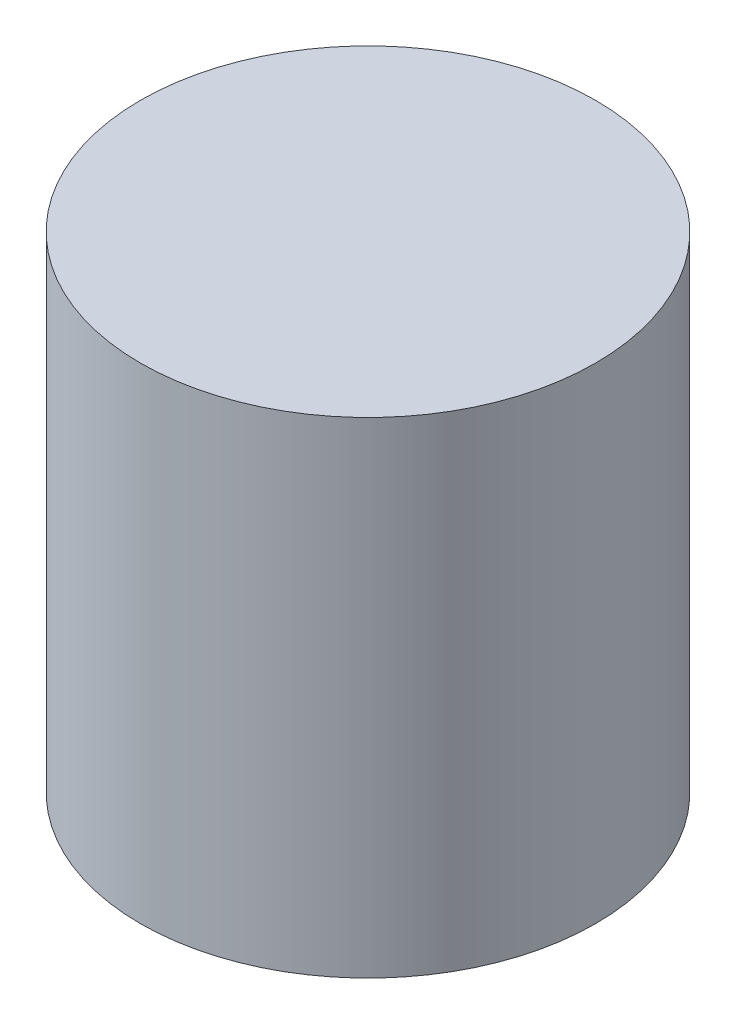
ISO-10303-21;
HEADER;
FILE_DESCRIPTION(('STEP AP214'),'2;1');
FILE_NAME('part.step','',(''),(''),'','','');
FILE_SCHEMA(('AUTOMOTIVE_DESIGN { 1 0 10303 214 1 1 1 1 }'));
ENDSEC;
DATA;
#1=APPLICATION_CONTEXT('core data for automotive mechanical design processes');
#2=APPLICATION_PROTOCOL_DEFINITION('international standard','automotive_design',2000,#1);
#3=PRODUCT_CONTEXT('',#1,'mechanical');
#4=PRODUCT('Part','Part','',(#3));
#5=PRODUCT_RELATED_PRODUCT_CATEGORY('part','',(#4));
#6=PRODUCT_DEFINITION_FORMATION('','',#4);
#7=PRODUCT_DEFINITION_CONTEXT('part definition',#1,'design');
#8=PRODUCT_DEFINITION('design','',#6,#7);
#9=PRODUCT_DEFINITION_SHAPE('','',#8);
#10=(LENGTH_UNIT() NAMED_UNIT(*) SI_UNIT(.MILLI.,.METRE.));
#11=(NAMED_UNIT(*) PLANE_ANGLE_UNIT() SI_UNIT($,.RADIAN.));
#12=(NAMED_UNIT(*) SI_UNIT($,.STERADIAN.) SOLID_ANGLE_UNIT());
#13=UNCERTAINTY_MEASURE_WITH_UNIT(LENGTH_MEASURE(1.E-05),#10,'distance_accuracy_value','');
#14=(GEOMETRIC_REPRESENTATION_CONTEXT(3) GLOBAL_UNCERTAINTY_ASSIGNED_CONTEXT((#13)) GLOBAL_UNIT_ASSIGNED_CONTEXT((#10,
#11,#12)) REPRESENTATION_CONTEXT('',''));
#15=CARTESIAN_POINT('',(0.,0.,0.));
#16=DIRECTION('',(0.,0.,1.));
#17=DIRECTION('',(1.,0.,0.));
#18=AXIS2_PLACEMENT_3D('',#15,#16,#17);
#19=CARTESIAN_POINT('',(0.,80.,0.));
#20=DIRECTION('',(0.,-1.,0.));
#21=DIRECTION('',(0.,0.,-1.));
#22=AXIS2_PLACEMENT_3D('',#19,#20,#21);
#23=CYLINDRICAL_SURFACE('',#22,37.5);
#24=CARTESIAN_POINT('',(0.,80.,0.));
#25=DIRECTION('',(0.,1.,0.));
#26=DIRECTION('',(0.,0.,1.));
#27=AXIS2_PLACEMENT_3D('',#24,#25,#26);
#28=CIRCLE('',#27,37.5);
#29=CARTESIAN_POINT('',(0.,80.,37.5));
#30=VERTEX_POINT('',#29);
#31=EDGE_CURVE('E10',#30,#30,#28,.T.);
#32=ORIENTED_EDGE('',*,*,#31,.F.);
#33=EDGE_LOOP('',(#32));
#34=FACE_BOUND('',#33,.T.);
#35=CARTESIAN_POINT('',(0.,0.,0.));
#36=DIRECTION('',(0.,1.,0.));
#37=DIRECTION('',(0.,0.,1.));
#38=AXIS2_PLACEMENT_3D('',#35,#36,#37);
#39=CIRCLE('',#38,37.5);
#40=CARTESIAN_POINT('',(0.,0.,37.5));
#41=VERTEX_POINT('',#40);
#42=EDGE_CURVE('E38',#41,#41,#39,.T.);
#43=ORIENTED_EDGE('',*,*,#42,.T.);
#44=EDGE_LOOP('',(#43));
#45=FACE_BOUND('',#44,.T.);
#46=ADVANCED_FACE('F35',(#34,#45),#23,.T.);
#47=CARTESIAN_POINT('',(0.,80.,0.));
#48=DIRECTION('',(0.,1.,0.));
#49=DIRECTION('',(0.,0.,1.));
#50=AXIS2_PLACEMENT_3D('',#47,#48,#49);
#51=PLANE('',#50);
#52=ORIENTED_EDGE('',*,*,#31,.T.);
#53=EDGE_LOOP('',(#52));
#54=FACE_BOUND('',#53,.T.);
#55=ADVANCED_FACE('F50',(#54),#51,.T.);
#56=CARTESIAN_POINT('',(0.,0.,0.));
#57=DIRECTION('',(0.,1.,0.));
#58=DIRECTION('',(0.,0.,1.));
#59=AXIS2_PLACEMENT_3D('',#56,#57,#58);
#60=PLANE('',#59);
#61=ORIENTED_EDGE('',*,*,#42,.F.);
#62=EDGE_LOOP('',(#61));
#63=FACE_BOUND('',#62,.T.);
#64=ADVANCED_FACE('F48',(#63),#60,.F.);
#65=CLOSED_SHELL('',(#46,#55,#64));
#66=MANIFOLD_SOLID_BREP('B2',#65);
#67=ADVANCED_BREP_SHAPE_REPRESENTATION('',(#18,#66),#14);
#68=SHAPE_DEFINITION_REPRESENTATION(#9,#67);
ENDSEC;
END-ISO-10303-21;
